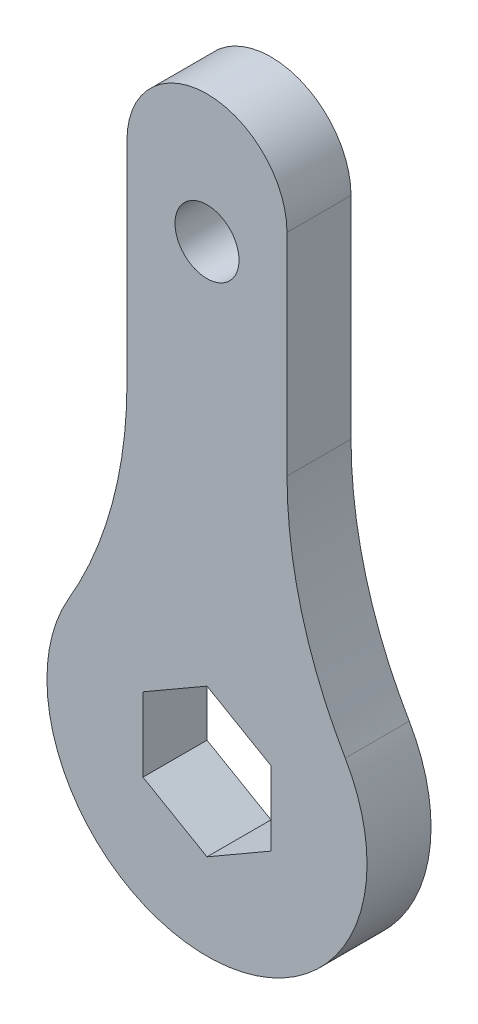
ISO-10303-21;
HEADER;
FILE_DESCRIPTION(('STEP AP214'),'2;1');
FILE_NAME('part.step','',(''),(''),'','','');
FILE_SCHEMA(('AUTOMOTIVE_DESIGN { 1 0 10303 214 1 1 1 1 }'));
ENDSEC;
DATA;
#1=APPLICATION_CONTEXT('core data for automotive mechanical design processes');
#2=APPLICATION_PROTOCOL_DEFINITION('international standard','automotive_design',2000,#1);
#3=PRODUCT_CONTEXT('',#1,'mechanical');
#4=PRODUCT('Part','Part','',(#3));
#5=PRODUCT_RELATED_PRODUCT_CATEGORY('part','',(#4));
#6=PRODUCT_DEFINITION_FORMATION('','',#4);
#7=PRODUCT_DEFINITION_CONTEXT('part definition',#1,'design');
#8=PRODUCT_DEFINITION('design','',#6,#7);
#9=PRODUCT_DEFINITION_SHAPE('','',#8);
#10=(LENGTH_UNIT() NAMED_UNIT(*) SI_UNIT(.MILLI.,.METRE.));
#11=(NAMED_UNIT(*) PLANE_ANGLE_UNIT() SI_UNIT($,.RADIAN.));
#12=(NAMED_UNIT(*) SI_UNIT($,.STERADIAN.) SOLID_ANGLE_UNIT());
#13=UNCERTAINTY_MEASURE_WITH_UNIT(LENGTH_MEASURE(1.E-05),#10,'distance_accuracy_value','');
#14=(GEOMETRIC_REPRESENTATION_CONTEXT(3) GLOBAL_UNCERTAINTY_ASSIGNED_CONTEXT((#13)) GLOBAL_UNIT_ASSIGNED_CONTEXT((#10,
#11,#12)) REPRESENTATION_CONTEXT('',''));
#15=CARTESIAN_POINT('',(0.,0.,0.));
#16=DIRECTION('',(0.,0.,1.));
#17=DIRECTION('',(1.,0.,0.));
#18=AXIS2_PLACEMENT_3D('',#15,#16,#17);
#19=CARTESIAN_POINT('',(0.,23.75,3.));
#20=DIRECTION('',(0.,0.,-1.));
#21=DIRECTION('',(-1.,0.,0.));
#22=AXIS2_PLACEMENT_3D('',#19,#20,#21);
#23=PLANE('',#22);
#24=CARTESIAN_POINT('',(0.,21.5,3.));
#25=DIRECTION('',(0.,0.,1.));
#26=DIRECTION('',(1.,0.,0.));
#27=AXIS2_PLACEMENT_3D('',#24,#25,#26);
#28=CIRCLE('',#27,1.5);
#29=CARTESIAN_POINT('',(1.5,21.5,3.));
#30=VERTEX_POINT('',#29);
#31=EDGE_CURVE('E332',#30,#30,#28,.T.);
#32=ORIENTED_EDGE('',*,*,#31,.F.);
#33=EDGE_LOOP('',(#32));
#34=FACE_BOUND('',#33,.T.);
#35=CARTESIAN_POINT('',(0.,23.75,3.));
#36=DIRECTION('',(0.,0.,1.));
#37=DIRECTION('',(-1.,0.,0.));
#38=AXIS2_PLACEMENT_3D('',#35,#36,#37);
#39=CIRCLE('',#38,3.75);
#40=CARTESIAN_POINT('',(3.75,23.75,3.));
#41=VERTEX_POINT('',#40);
#42=CARTESIAN_POINT('',(-3.75,23.75,3.));
#43=VERTEX_POINT('',#42);
#44=EDGE_CURVE('E202',#41,#43,#39,.T.);
#45=ORIENTED_EDGE('',*,*,#44,.T.);
#46=DIRECTION('',(0.,-1.,0.));
#47=VECTOR('',#46,1.);
#48=CARTESIAN_POINT('',(-3.75,13.8631706330118,3.));
#49=LINE('',#48,#47);
#50=CARTESIAN_POINT('',(-3.75,13.8631706330118,3.));
#51=VERTEX_POINT('',#50);
#52=EDGE_CURVE('E206',#43,#51,#49,.T.);
#53=ORIENTED_EDGE('',*,*,#52,.T.);
#54=CARTESIAN_POINT('',(-23.75,13.8631706330118,3.));
#55=DIRECTION('',(0.,0.,-1.));
#56=DIRECTION('',(-1.,0.,0.));
#57=AXIS2_PLACEMENT_3D('',#54,#55,#56);
#58=CIRCLE('',#57,20.);
#59=CARTESIAN_POINT('',(-6.47727272727273,3.78086471809412,3.));
#60=VERTEX_POINT('',#59);
#61=EDGE_CURVE('E210',#51,#60,#58,.T.);
#62=ORIENTED_EDGE('',*,*,#61,.T.);
#63=CARTESIAN_POINT('',(0.,0.,3.));
#64=DIRECTION('',(0.,0.,1.));
#65=DIRECTION('',(1.,0.,0.));
#66=AXIS2_PLACEMENT_3D('',#63,#64,#65);
#67=CIRCLE('',#66,7.5);
#68=CARTESIAN_POINT('',(6.47727272727273,3.78086471809413,3.));
#69=VERTEX_POINT('',#68);
#70=EDGE_CURVE('E213',#60,#69,#67,.T.);
#71=ORIENTED_EDGE('',*,*,#70,.T.);
#72=CARTESIAN_POINT('',(23.75,13.8631706330118,3.));
#73=DIRECTION('',(0.,0.,-1.));
#74=DIRECTION('',(1.,0.,0.));
#75=AXIS2_PLACEMENT_3D('',#72,#73,#74);
#76=CIRCLE('',#75,20.);
#77=CARTESIAN_POINT('',(3.75,13.8631706330118,3.));
#78=VERTEX_POINT('',#77);
#79=EDGE_CURVE('E216',#69,#78,#76,.T.);
#80=ORIENTED_EDGE('',*,*,#79,.T.);
#81=DIRECTION('',(0.,1.,0.));
#82=VECTOR('',#81,1.);
#83=CARTESIAN_POINT('',(3.75,13.8631706330118,3.));
#84=LINE('',#83,#82);
#85=EDGE_CURVE('E219',#78,#41,#84,.T.);
#86=ORIENTED_EDGE('',*,*,#85,.T.);
#87=EDGE_LOOP('',(#45,#53,#62,#71,#80,#86));
#88=FACE_BOUND('',#87,.T.);
#89=DIRECTION('',(-0.866025403784439,0.5,0.));
#90=VECTOR('',#89,1.);
#91=CARTESIAN_POINT('',(3.,1.73205080756888,3.));
#92=LINE('',#91,#90);
#93=CARTESIAN_POINT('',(3.,1.73205080756888,3.));
#94=VERTEX_POINT('',#93);
#95=CARTESIAN_POINT('',(0.,3.46410161513776,3.));
#96=VERTEX_POINT('',#95);
#97=EDGE_CURVE('E132',#94,#96,#92,.T.);
#98=ORIENTED_EDGE('',*,*,#97,.F.);
#99=DIRECTION('',(0.,1.,0.));
#100=VECTOR('',#99,1.);
#101=CARTESIAN_POINT('',(3.,-1.73205080756888,3.));
#102=LINE('',#101,#100);
#103=CARTESIAN_POINT('',(3.,-1.73205080756888,3.));
#104=VERTEX_POINT('',#103);
#105=EDGE_CURVE('E168',#104,#94,#102,.T.);
#106=ORIENTED_EDGE('',*,*,#105,.F.);
#107=DIRECTION('',(0.866025403784439,0.5,0.));
#108=VECTOR('',#107,1.);
#109=CARTESIAN_POINT('',(0.,-3.46410161513776,3.));
#110=LINE('',#109,#108);
#111=CARTESIAN_POINT('',(0.,-3.46410161513776,3.));
#112=VERTEX_POINT('',#111);
#113=EDGE_CURVE('E165',#112,#104,#110,.T.);
#114=ORIENTED_EDGE('',*,*,#113,.F.);
#115=DIRECTION('',(0.866025403784439,-0.5,0.));
#116=VECTOR('',#115,1.);
#117=CARTESIAN_POINT('',(-3.,-1.73205080756888,3.));
#118=LINE('',#117,#116);
#119=CARTESIAN_POINT('',(-3.,-1.73205080756888,3.));
#120=VERTEX_POINT('',#119);
#121=EDGE_CURVE('E159',#120,#112,#118,.T.);
#122=ORIENTED_EDGE('',*,*,#121,.F.);
#123=DIRECTION('',(0.,-1.,0.));
#124=VECTOR('',#123,1.);
#125=CARTESIAN_POINT('',(-3.,1.73205080756888,3.));
#126=LINE('',#125,#124);
#127=CARTESIAN_POINT('',(-3.,1.73205080756888,3.));
#128=VERTEX_POINT('',#127);
#129=EDGE_CURVE('E155',#128,#120,#126,.T.);
#130=ORIENTED_EDGE('',*,*,#129,.F.);
#131=DIRECTION('',(-0.866025403784439,-0.5,0.));
#132=VECTOR('',#131,1.);
#133=CARTESIAN_POINT('',(0.,3.46410161513776,3.));
#134=LINE('',#133,#132);
#135=EDGE_CURVE('E141',#96,#128,#134,.T.);
#136=ORIENTED_EDGE('',*,*,#135,.F.);
#137=EDGE_LOOP('',(#98,#106,#114,#122,#130,#136));
#138=FACE_BOUND('',#137,.T.);
#139=ADVANCED_FACE('F41',(#34,#88,#138),#23,.F.);
#140=CARTESIAN_POINT('',(0.,23.75,0.));
#141=DIRECTION('',(0.,0.,-1.));
#142=DIRECTION('',(-1.,0.,0.));
#143=AXIS2_PLACEMENT_3D('',#140,#141,#142);
#144=PLANE('',#143);
#145=CARTESIAN_POINT('',(0.,21.5,0.));
#146=DIRECTION('',(0.,0.,-1.));
#147=DIRECTION('',(-1.,0.,0.));
#148=AXIS2_PLACEMENT_3D('',#145,#146,#147);
#149=CIRCLE('',#148,1.5);
#150=CARTESIAN_POINT('',(-1.5,21.5,0.));
#151=VERTEX_POINT('',#150);
#152=EDGE_CURVE('E45',#151,#151,#149,.T.);
#153=ORIENTED_EDGE('',*,*,#152,.F.);
#154=EDGE_LOOP('',(#153));
#155=FACE_BOUND('',#154,.T.);
#156=CARTESIAN_POINT('',(0.,23.75,0.));
#157=DIRECTION('',(0.,0.,1.));
#158=DIRECTION('',(-1.,0.,0.));
#159=AXIS2_PLACEMENT_3D('',#156,#157,#158);
#160=CIRCLE('',#159,3.75);
#161=CARTESIAN_POINT('',(3.75,23.75,0.));
#162=VERTEX_POINT('',#161);
#163=CARTESIAN_POINT('',(-3.75,23.75,0.));
#164=VERTEX_POINT('',#163);
#165=EDGE_CURVE('E150',#162,#164,#160,.T.);
#166=ORIENTED_EDGE('',*,*,#165,.F.);
#167=DIRECTION('',(0.,1.,0.));
#168=VECTOR('',#167,1.);
#169=CARTESIAN_POINT('',(3.75,13.8631706330118,0.));
#170=LINE('',#169,#168);
#171=CARTESIAN_POINT('',(3.75,13.8631706330118,0.));
#172=VERTEX_POINT('',#171);
#173=EDGE_CURVE('E207',#172,#162,#170,.T.);
#174=ORIENTED_EDGE('',*,*,#173,.F.);
#175=CARTESIAN_POINT('',(23.75,13.8631706330118,0.));
#176=DIRECTION('',(0.,0.,-1.));
#177=DIRECTION('',(1.,0.,0.));
#178=AXIS2_PLACEMENT_3D('',#175,#176,#177);
#179=CIRCLE('',#178,20.);
#180=CARTESIAN_POINT('',(6.47727272727273,3.78086471809413,0.));
#181=VERTEX_POINT('',#180);
#182=EDGE_CURVE('E235',#181,#172,#179,.T.);
#183=ORIENTED_EDGE('',*,*,#182,.F.);
#184=CARTESIAN_POINT('',(0.,0.,0.));
#185=DIRECTION('',(0.,0.,1.));
#186=DIRECTION('',(1.,0.,0.));
#187=AXIS2_PLACEMENT_3D('',#184,#185,#186);
#188=CIRCLE('',#187,7.5);
#189=CARTESIAN_POINT('',(-6.47727272727273,3.78086471809412,0.));
#190=VERTEX_POINT('',#189);
#191=EDGE_CURVE('E232',#190,#181,#188,.T.);
#192=ORIENTED_EDGE('',*,*,#191,.F.);
#193=CARTESIAN_POINT('',(-23.75,13.8631706330118,0.));
#194=DIRECTION('',(0.,0.,-1.));
#195=DIRECTION('',(-1.,0.,0.));
#196=AXIS2_PLACEMENT_3D('',#193,#194,#195);
#197=CIRCLE('',#196,20.);
#198=CARTESIAN_POINT('',(-3.75,13.8631706330118,0.));
#199=VERTEX_POINT('',#198);
#200=EDGE_CURVE('E229',#199,#190,#197,.T.);
#201=ORIENTED_EDGE('',*,*,#200,.F.);
#202=DIRECTION('',(0.,-1.,0.));
#203=VECTOR('',#202,1.);
#204=CARTESIAN_POINT('',(-3.75,13.8631706330118,0.));
#205=LINE('',#204,#203);
#206=EDGE_CURVE('E226',#164,#199,#205,.T.);
#207=ORIENTED_EDGE('',*,*,#206,.F.);
#208=EDGE_LOOP('',(#166,#174,#183,#192,#201,#207));
#209=FACE_BOUND('',#208,.T.);
#210=DIRECTION('',(0.,1.,0.));
#211=VECTOR('',#210,1.);
#212=CARTESIAN_POINT('',(3.,-1.73205080756888,0.));
#213=LINE('',#212,#211);
#214=CARTESIAN_POINT('',(3.,-1.73205080756888,0.));
#215=VERTEX_POINT('',#214);
#216=CARTESIAN_POINT('',(3.,1.73205080756888,0.));
#217=VERTEX_POINT('',#216);
#218=EDGE_CURVE('E142',#215,#217,#213,.T.);
#219=ORIENTED_EDGE('',*,*,#218,.T.);
#220=DIRECTION('',(-0.866025403784439,0.5,0.));
#221=VECTOR('',#220,1.);
#222=CARTESIAN_POINT('',(3.,1.73205080756888,0.));
#223=LINE('',#222,#221);
#224=CARTESIAN_POINT('',(0.,3.46410161513776,0.));
#225=VERTEX_POINT('',#224);
#226=EDGE_CURVE('E66',#217,#225,#223,.T.);
#227=ORIENTED_EDGE('',*,*,#226,.T.);
#228=DIRECTION('',(-0.866025403784439,-0.5,0.));
#229=VECTOR('',#228,1.);
#230=CARTESIAN_POINT('',(0.,3.46410161513776,0.));
#231=LINE('',#230,#229);
#232=CARTESIAN_POINT('',(-3.,1.73205080756888,0.));
#233=VERTEX_POINT('',#232);
#234=EDGE_CURVE('E148',#225,#233,#231,.T.);
#235=ORIENTED_EDGE('',*,*,#234,.T.);
#236=DIRECTION('',(0.,-1.,0.));
#237=VECTOR('',#236,1.);
#238=CARTESIAN_POINT('',(-3.,1.73205080756888,0.));
#239=LINE('',#238,#237);
#240=CARTESIAN_POINT('',(-3.,-1.73205080756888,0.));
#241=VERTEX_POINT('',#240);
#242=EDGE_CURVE('E175',#233,#241,#239,.T.);
#243=ORIENTED_EDGE('',*,*,#242,.T.);
#244=DIRECTION('',(0.866025403784439,-0.5,0.));
#245=VECTOR('',#244,1.);
#246=CARTESIAN_POINT('',(-3.,-1.73205080756888,0.));
#247=LINE('',#246,#245);
#248=CARTESIAN_POINT('',(0.,-3.46410161513776,0.));
#249=VERTEX_POINT('',#248);
#250=EDGE_CURVE('E179',#241,#249,#247,.T.);
#251=ORIENTED_EDGE('',*,*,#250,.T.);
#252=DIRECTION('',(0.866025403784439,0.5,0.));
#253=VECTOR('',#252,1.);
#254=CARTESIAN_POINT('',(0.,-3.46410161513776,0.));
#255=LINE('',#254,#253);
#256=EDGE_CURVE('E183',#249,#215,#255,.T.);
#257=ORIENTED_EDGE('',*,*,#256,.T.);
#258=EDGE_LOOP('',(#219,#227,#235,#243,#251,#257));
#259=FACE_BOUND('',#258,.T.);
#260=ADVANCED_FACE('F267',(#155,#209,#259),#144,.T.);
#261=CARTESIAN_POINT('',(0.,23.75,3.));
#262=DIRECTION('',(0.,0.,-1.));
#263=DIRECTION('',(-1.,0.,0.));
#264=AXIS2_PLACEMENT_3D('',#261,#262,#263);
#265=CYLINDRICAL_SURFACE('',#264,3.75);
#266=ORIENTED_EDGE('',*,*,#165,.T.);
#267=DIRECTION('',(0.,0.,-1.));
#268=VECTOR('',#267,1.);
#269=CARTESIAN_POINT('',(-3.75,23.75,3.));
#270=LINE('',#269,#268);
#271=EDGE_CURVE('E11',#43,#164,#270,.T.);
#272=ORIENTED_EDGE('',*,*,#271,.F.);
#273=ORIENTED_EDGE('',*,*,#44,.F.);
#274=DIRECTION('',(0.,0.,-1.));
#275=VECTOR('',#274,1.);
#276=CARTESIAN_POINT('',(3.75,23.75,3.));
#277=LINE('',#276,#275);
#278=EDGE_CURVE('E222',#41,#162,#277,.T.);
#279=ORIENTED_EDGE('',*,*,#278,.T.);
#280=EDGE_LOOP('',(#266,#272,#273,#279));
#281=FACE_BOUND('',#280,.T.);
#282=ADVANCED_FACE('F43',(#281),#265,.T.);
#283=CARTESIAN_POINT('',(-3.75,13.8631706330118,3.));
#284=DIRECTION('',(1.,0.,0.));
#285=DIRECTION('',(0.,0.,-1.));
#286=AXIS2_PLACEMENT_3D('',#283,#284,#285);
#287=PLANE('',#286);
#288=ORIENTED_EDGE('',*,*,#206,.T.);
#289=DIRECTION('',(0.,0.,-1.));
#290=VECTOR('',#289,1.);
#291=CARTESIAN_POINT('',(-3.75,13.8631706330118,3.));
#292=LINE('',#291,#290);
#293=EDGE_CURVE('E51',#51,#199,#292,.T.);
#294=ORIENTED_EDGE('',*,*,#293,.F.);
#295=ORIENTED_EDGE('',*,*,#52,.F.);
#296=ORIENTED_EDGE('',*,*,#271,.T.);
#297=EDGE_LOOP('',(#288,#294,#295,#296));
#298=FACE_BOUND('',#297,.T.);
#299=ADVANCED_FACE('F284',(#298),#287,.F.);
#300=CARTESIAN_POINT('',(-23.75,13.8631706330118,3.));
#301=DIRECTION('',(0.,0.,-1.));
#302=DIRECTION('',(-1.,0.,0.));
#303=AXIS2_PLACEMENT_3D('',#300,#301,#302);
#304=CYLINDRICAL_SURFACE('',#303,20.);
#305=ORIENTED_EDGE('',*,*,#200,.T.);
#306=DIRECTION('',(0.,0.,-1.));
#307=VECTOR('',#306,1.);
#308=CARTESIAN_POINT('',(-6.47727272727273,3.78086471809412,3.));
#309=LINE('',#308,#307);
#310=EDGE_CURVE('E251',#60,#190,#309,.T.);
#311=ORIENTED_EDGE('',*,*,#310,.F.);
#312=ORIENTED_EDGE('',*,*,#61,.F.);
#313=ORIENTED_EDGE('',*,*,#293,.T.);
#314=EDGE_LOOP('',(#305,#311,#312,#313));
#315=FACE_BOUND('',#314,.T.);
#316=ADVANCED_FACE('F261',(#315),#304,.F.);
#317=CARTESIAN_POINT('',(0.,0.,3.));
#318=DIRECTION('',(0.,0.,-1.));
#319=DIRECTION('',(-1.,0.,0.));
#320=AXIS2_PLACEMENT_3D('',#317,#318,#319);
#321=CYLINDRICAL_SURFACE('',#320,7.5);
#322=ORIENTED_EDGE('',*,*,#191,.T.);
#323=DIRECTION('',(0.,0.,-1.));
#324=VECTOR('',#323,1.);
#325=CARTESIAN_POINT('',(6.47727272727273,3.78086471809413,3.));
#326=LINE('',#325,#324);
#327=EDGE_CURVE('E247',#69,#181,#326,.T.);
#328=ORIENTED_EDGE('',*,*,#327,.F.);
#329=ORIENTED_EDGE('',*,*,#70,.F.);
#330=ORIENTED_EDGE('',*,*,#310,.T.);
#331=EDGE_LOOP('',(#322,#328,#329,#330));
#332=FACE_BOUND('',#331,.T.);
#333=ADVANCED_FACE('F273',(#332),#321,.T.);
#334=CARTESIAN_POINT('',(23.75,13.8631706330118,3.));
#335=DIRECTION('',(0.,0.,-1.));
#336=DIRECTION('',(-1.,0.,0.));
#337=AXIS2_PLACEMENT_3D('',#334,#335,#336);
#338=CYLINDRICAL_SURFACE('',#337,20.);
#339=ORIENTED_EDGE('',*,*,#182,.T.);
#340=DIRECTION('',(0.,0.,-1.));
#341=VECTOR('',#340,1.);
#342=CARTESIAN_POINT('',(3.75,13.8631706330118,3.));
#343=LINE('',#342,#341);
#344=EDGE_CURVE('E243',#78,#172,#343,.T.);
#345=ORIENTED_EDGE('',*,*,#344,.F.);
#346=ORIENTED_EDGE('',*,*,#79,.F.);
#347=ORIENTED_EDGE('',*,*,#327,.T.);
#348=EDGE_LOOP('',(#339,#345,#346,#347));
#349=FACE_BOUND('',#348,.T.);
#350=ADVANCED_FACE('F277',(#349),#338,.F.);
#351=CARTESIAN_POINT('',(3.75,13.8631706330118,3.));
#352=DIRECTION('',(-1.,0.,0.));
#353=DIRECTION('',(0.,0.,1.));
#354=AXIS2_PLACEMENT_3D('',#351,#352,#353);
#355=PLANE('',#354);
#356=ORIENTED_EDGE('',*,*,#173,.T.);
#357=ORIENTED_EDGE('',*,*,#278,.F.);
#358=ORIENTED_EDGE('',*,*,#85,.F.);
#359=ORIENTED_EDGE('',*,*,#344,.T.);
#360=EDGE_LOOP('',(#356,#357,#358,#359));
#361=FACE_BOUND('',#360,.T.);
#362=ADVANCED_FACE('F287',(#361),#355,.F.);
#363=CARTESIAN_POINT('',(3.,1.73205080756888,3.));
#364=DIRECTION('',(-0.5,-0.866025403784439,0.));
#365=DIRECTION('',(0.866025403784439,-0.5,0.));
#366=AXIS2_PLACEMENT_3D('',#363,#364,#365);
#367=PLANE('',#366);
#368=ORIENTED_EDGE('',*,*,#226,.F.);
#369=DIRECTION('',(0.,0.,-1.));
#370=VECTOR('',#369,1.);
#371=CARTESIAN_POINT('',(3.,1.73205080756888,3.));
#372=LINE('',#371,#370);
#373=EDGE_CURVE('E136',#94,#217,#372,.T.);
#374=ORIENTED_EDGE('',*,*,#373,.F.);
#375=ORIENTED_EDGE('',*,*,#97,.T.);
#376=DIRECTION('',(0.,0.,-1.));
#377=VECTOR('',#376,1.);
#378=CARTESIAN_POINT('',(0.,3.46410161513776,3.));
#379=LINE('',#378,#377);
#380=EDGE_CURVE('E135',#96,#225,#379,.T.);
#381=ORIENTED_EDGE('',*,*,#380,.T.);
#382=EDGE_LOOP('',(#368,#374,#375,#381));
#383=FACE_BOUND('',#382,.T.);
#384=ADVANCED_FACE('F134',(#383),#367,.T.);
#385=CARTESIAN_POINT('',(0.,3.46410161513776,3.));
#386=DIRECTION('',(0.5,-0.866025403784439,0.));
#387=DIRECTION('',(0.866025403784439,0.5,0.));
#388=AXIS2_PLACEMENT_3D('',#385,#386,#387);
#389=PLANE('',#388);
#390=ORIENTED_EDGE('',*,*,#234,.F.);
#391=ORIENTED_EDGE('',*,*,#380,.F.);
#392=ORIENTED_EDGE('',*,*,#135,.T.);
#393=DIRECTION('',(0.,0.,-1.));
#394=VECTOR('',#393,1.);
#395=CARTESIAN_POINT('',(-3.,1.73205080756888,3.));
#396=LINE('',#395,#394);
#397=EDGE_CURVE('E151',#128,#233,#396,.T.);
#398=ORIENTED_EDGE('',*,*,#397,.T.);
#399=EDGE_LOOP('',(#390,#391,#392,#398));
#400=FACE_BOUND('',#399,.T.);
#401=ADVANCED_FACE('F145',(#400),#389,.T.);
#402=CARTESIAN_POINT('',(-3.,1.73205080756888,3.));
#403=DIRECTION('',(1.,0.,0.));
#404=DIRECTION('',(0.,1.,0.));
#405=AXIS2_PLACEMENT_3D('',#402,#403,#404);
#406=PLANE('',#405);
#407=ORIENTED_EDGE('',*,*,#242,.F.);
#408=ORIENTED_EDGE('',*,*,#397,.F.);
#409=ORIENTED_EDGE('',*,*,#129,.T.);
#410=DIRECTION('',(0.,0.,-1.));
#411=VECTOR('',#410,1.);
#412=CARTESIAN_POINT('',(-3.,-1.73205080756888,3.));
#413=LINE('',#412,#411);
#414=EDGE_CURVE('E197',#120,#241,#413,.T.);
#415=ORIENTED_EDGE('',*,*,#414,.T.);
#416=EDGE_LOOP('',(#407,#408,#409,#415));
#417=FACE_BOUND('',#416,.T.);
#418=ADVANCED_FACE('F308',(#417),#406,.T.);
#419=CARTESIAN_POINT('',(-3.,-1.73205080756888,3.));
#420=DIRECTION('',(0.5,0.866025403784439,0.));
#421=DIRECTION('',(-0.866025403784439,0.5,0.));
#422=AXIS2_PLACEMENT_3D('',#419,#420,#421);
#423=PLANE('',#422);
#424=ORIENTED_EDGE('',*,*,#250,.F.);
#425=ORIENTED_EDGE('',*,*,#414,.F.);
#426=ORIENTED_EDGE('',*,*,#121,.T.);
#427=DIRECTION('',(0.,0.,-1.));
#428=VECTOR('',#427,1.);
#429=CARTESIAN_POINT('',(0.,-3.46410161513776,3.));
#430=LINE('',#429,#428);
#431=EDGE_CURVE('E194',#112,#249,#430,.T.);
#432=ORIENTED_EDGE('',*,*,#431,.T.);
#433=EDGE_LOOP('',(#424,#425,#426,#432));
#434=FACE_BOUND('',#433,.T.);
#435=ADVANCED_FACE('F311',(#434),#423,.T.);
#436=CARTESIAN_POINT('',(0.,-3.46410161513776,3.));
#437=DIRECTION('',(-0.5,0.866025403784439,0.));
#438=DIRECTION('',(-0.866025403784439,-0.5,0.));
#439=AXIS2_PLACEMENT_3D('',#436,#437,#438);
#440=PLANE('',#439);
#441=ORIENTED_EDGE('',*,*,#256,.F.);
#442=ORIENTED_EDGE('',*,*,#431,.F.);
#443=ORIENTED_EDGE('',*,*,#113,.T.);
#444=DIRECTION('',(0.,0.,-1.));
#445=VECTOR('',#444,1.);
#446=CARTESIAN_POINT('',(3.,-1.73205080756888,3.));
#447=LINE('',#446,#445);
#448=EDGE_CURVE('E58',#104,#215,#447,.T.);
#449=ORIENTED_EDGE('',*,*,#448,.T.);
#450=EDGE_LOOP('',(#441,#442,#443,#449));
#451=FACE_BOUND('',#450,.T.);
#452=ADVANCED_FACE('F315',(#451),#440,.T.);
#453=CARTESIAN_POINT('',(3.,-1.73205080756888,3.));
#454=DIRECTION('',(-1.,0.,0.));
#455=DIRECTION('',(0.,0.,1.));
#456=AXIS2_PLACEMENT_3D('',#453,#454,#455);
#457=PLANE('',#456);
#458=ORIENTED_EDGE('',*,*,#218,.F.);
#459=ORIENTED_EDGE('',*,*,#448,.F.);
#460=ORIENTED_EDGE('',*,*,#105,.T.);
#461=ORIENTED_EDGE('',*,*,#373,.T.);
#462=EDGE_LOOP('',(#458,#459,#460,#461));
#463=FACE_BOUND('',#462,.T.);
#464=ADVANCED_FACE('F319',(#463),#457,.T.);
#465=CARTESIAN_POINT('',(0.,21.5,-7.));
#466=DIRECTION('',(0.,0.,1.));
#467=DIRECTION('',(1.,0.,0.));
#468=AXIS2_PLACEMENT_3D('',#465,#466,#467);
#469=CYLINDRICAL_SURFACE('',#468,1.5);
#470=ORIENTED_EDGE('',*,*,#152,.T.);
#471=EDGE_LOOP('',(#470));
#472=FACE_BOUND('',#471,.T.);
#473=ORIENTED_EDGE('',*,*,#31,.T.);
#474=EDGE_LOOP('',(#473));
#475=FACE_BOUND('',#474,.T.);
#476=ADVANCED_FACE('F323',(#472,#475),#469,.F.);
#477=CLOSED_SHELL('',(#139,#260,#282,#299,#316,#333,#350,#362,#384,#401,#418,#435,#452,#464,#476));
#478=MANIFOLD_SOLID_BREP('B2',#477);
#479=ADVANCED_BREP_SHAPE_REPRESENTATION('',(#18,#478),#14);
#480=SHAPE_DEFINITION_REPRESENTATION(#9,#479);
ENDSEC;
END-ISO-10303-21;
